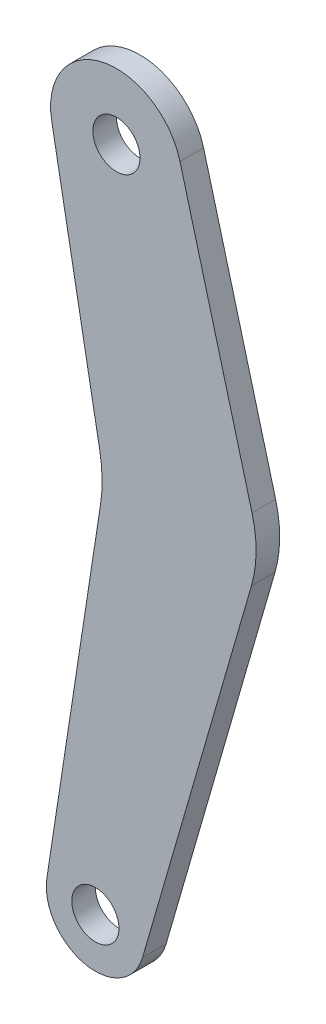
ISO-10303-21;
HEADER;
FILE_DESCRIPTION(('STEP AP214'),'2;1');
FILE_NAME('part.step','',(''),(''),'','','');
FILE_SCHEMA(('AUTOMOTIVE_DESIGN { 1 0 10303 214 1 1 1 1 }'));
ENDSEC;
DATA;
#1=APPLICATION_CONTEXT('core data for automotive mechanical design processes');
#2=APPLICATION_PROTOCOL_DEFINITION('international standard','automotive_design',2000,#1);
#3=PRODUCT_CONTEXT('',#1,'mechanical');
#4=PRODUCT('Part','Part','',(#3));
#5=PRODUCT_RELATED_PRODUCT_CATEGORY('part','',(#4));
#6=PRODUCT_DEFINITION_FORMATION('','',#4);
#7=PRODUCT_DEFINITION_CONTEXT('part definition',#1,'design');
#8=PRODUCT_DEFINITION('design','',#6,#7);
#9=PRODUCT_DEFINITION_SHAPE('','',#8);
#10=(LENGTH_UNIT() NAMED_UNIT(*) SI_UNIT(.MILLI.,.METRE.));
#11=(NAMED_UNIT(*) PLANE_ANGLE_UNIT() SI_UNIT($,.RADIAN.));
#12=(NAMED_UNIT(*) SI_UNIT($,.STERADIAN.) SOLID_ANGLE_UNIT());
#13=UNCERTAINTY_MEASURE_WITH_UNIT(LENGTH_MEASURE(1.E-05),#10,'distance_accuracy_value','');
#14=(GEOMETRIC_REPRESENTATION_CONTEXT(3) GLOBAL_UNCERTAINTY_ASSIGNED_CONTEXT((#13)) GLOBAL_UNIT_ASSIGNED_CONTEXT((#10,
#11,#12)) REPRESENTATION_CONTEXT('',''));
#15=CARTESIAN_POINT('',(0.,0.,0.));
#16=DIRECTION('',(0.,0.,1.));
#17=DIRECTION('',(1.,0.,0.));
#18=AXIS2_PLACEMENT_3D('',#15,#16,#17);
#19=CARTESIAN_POINT('',(-38.3285591147178,327.00705744007,0.));
#20=DIRECTION('',(0.,0.,1.));
#21=DIRECTION('',(1.,0.,0.));
#22=AXIS2_PLACEMENT_3D('',#19,#20,#21);
#23=PLANE('',#22);
#24=CARTESIAN_POINT('',(-38.3285591147178,327.00705744007,0.));
#25=DIRECTION('',(0.,0.,-1.));
#26=DIRECTION('',(-1.,0.,0.));
#27=AXIS2_PLACEMENT_3D('',#24,#25,#26);
#28=CIRCLE('',#27,0.999998000006309);
#29=CARTESIAN_POINT('',(-39.3285571147241,327.00705744007,0.));
#30=VERTEX_POINT('',#29);
#31=EDGE_CURVE('E109',#30,#30,#28,.F.);
#32=ORIENTED_EDGE('',*,*,#31,.T.);
#33=EDGE_LOOP('',(#32));
#34=FACE_BOUND('',#33,.T.);
#35=DIRECTION('',(0.151433090633254,0.988467510372122,0.));
#36=VECTOR('',#35,1.);
#37=CARTESIAN_POINT('',(-38.1119178424366,342.156577861668,0.));
#38=LINE('',#37,#36);
#39=CARTESIAN_POINT('',(-40.3845674242654,327.322037638626,0.));
#40=VERTEX_POINT('',#39);
#41=CARTESIAN_POINT('',(-38.1119178424365,342.156577861668,0.));
#42=VERTEX_POINT('',#41);
#43=EDGE_CURVE('E107',#40,#42,#38,.T.);
#44=ORIENTED_EDGE('',*,*,#43,.T.);
#45=CARTESIAN_POINT('',(-44.0427110430554,343.065174588271,0.));
#46=DIRECTION('',(0.,0.,-1.));
#47=DIRECTION('',(-1.,0.,0.));
#48=AXIS2_PLACEMENT_3D('',#45,#46,#47);
#49=CIRCLE('',#48,5.99998799999629);
#50=CARTESIAN_POINT('',(-38.1418631818201,344.151383830845,0.));
#51=VERTEX_POINT('',#50);
#52=EDGE_CURVE('E136',#42,#51,#49,.F.);
#53=ORIENTED_EDGE('',*,*,#52,.T.);
#54=DIRECTION('',(-0.181035235833503,0.983476610492953,0.));
#55=VECTOR('',#54,1.);
#56=CARTESIAN_POINT('',(-40.1796908064502,355.221912702271,0.));
#57=LINE('',#56,#55);
#58=CARTESIAN_POINT('',(-40.1796908064501,355.22191270227,0.));
#59=VERTEX_POINT('',#58);
#60=EDGE_CURVE('E110',#51,#59,#57,.T.);
#61=ORIENTED_EDGE('',*,*,#60,.T.);
#62=CARTESIAN_POINT('',(-37.4357965509737,355.727000000069,0.));
#63=DIRECTION('',(0.,0.,-1.));
#64=DIRECTION('',(-1.,0.,0.));
#65=AXIS2_PLACEMENT_3D('',#62,#63,#64);
#66=CIRCLE('',#65,2.78999442000039);
#67=CARTESIAN_POINT('',(-34.7412481703734,356.450517718053,0.));
#68=VERTEX_POINT('',#67);
#69=EDGE_CURVE('E139',#68,#59,#66,.F.);
#70=ORIENTED_EDGE('',*,*,#69,.F.);
#71=DIRECTION('',(0.259325865599312,-0.965789881615648,0.));
#72=VECTOR('',#71,1.);
#73=CARTESIAN_POINT('',(-31.6863937766294,345.073528938053,0.));
#74=LINE('',#73,#72);
#75=CARTESIAN_POINT('',(-31.6863937766299,345.073528938055,0.));
#76=VERTEX_POINT('',#75);
#77=EDGE_CURVE('E115',#68,#76,#74,.T.);
#78=ORIENTED_EDGE('',*,*,#77,.T.);
#79=CARTESIAN_POINT('',(-36.5153335268104,343.776902203319,0.));
#80=DIRECTION('',(0.,0.,-1.));
#81=DIRECTION('',(-1.,0.,0.));
#82=AXIS2_PLACEMENT_3D('',#79,#80,#81);
#83=CIRCLE('',#82,4.99999000000056);
#84=CARTESIAN_POINT('',(-31.7124149624369,342.386983765388,0.));
#85=VERTEX_POINT('',#84);
#86=EDGE_CURVE('E95',#85,#76,#83,.F.);
#87=ORIENTED_EDGE('',*,*,#86,.F.);
#88=DIRECTION('',(-0.277984243554049,-0.960585634046066,0.));
#89=VECTOR('',#88,1.);
#90=CARTESIAN_POINT('',(-36.3305449919396,326.428851369893,0.));
#91=LINE('',#90,#89);
#92=CARTESIAN_POINT('',(-36.3305449919397,326.428851369893,0.));
#93=VERTEX_POINT('',#92);
#94=EDGE_CURVE('E92',#85,#93,#91,.T.);
#95=ORIENTED_EDGE('',*,*,#94,.T.);
#96=CARTESIAN_POINT('',(-38.3285591147178,327.00705744007,0.));
#97=DIRECTION('',(0.,0.,-1.));
#98=DIRECTION('',(-1.,0.,0.));
#99=AXIS2_PLACEMENT_3D('',#96,#97,#98);
#100=CIRCLE('',#99,2.07999583999845);
#101=EDGE_CURVE('E80',#40,#93,#100,.F.);
#102=ORIENTED_EDGE('',*,*,#101,.F.);
#103=EDGE_LOOP('',(#44,#53,#61,#70,#78,#87,#95,#102));
#104=FACE_BOUND('',#103,.T.);
#105=CARTESIAN_POINT('',(-37.4357965509737,355.727000000069,0.));
#106=DIRECTION('',(0.,0.,-1.));
#107=DIRECTION('',(-1.,0.,0.));
#108=AXIS2_PLACEMENT_3D('',#105,#106,#107);
#109=CIRCLE('',#108,0.999998000004054);
#110=CARTESIAN_POINT('',(-38.4357945509778,355.727000000069,0.));
#111=VERTEX_POINT('',#110);
#112=EDGE_CURVE('E20',#111,#111,#109,.F.);
#113=ORIENTED_EDGE('',*,*,#112,.T.);
#114=EDGE_LOOP('',(#113));
#115=FACE_BOUND('',#114,.T.);
#116=ADVANCED_FACE('F17',(#34,#104,#115),#23,.F.);
#117=CARTESIAN_POINT('',(-37.4357965509737,355.727000000069,1.));
#118=DIRECTION('',(0.,0.,-1.));
#119=DIRECTION('',(-1.,0.,0.));
#120=AXIS2_PLACEMENT_3D('',#117,#118,#119);
#121=CYLINDRICAL_SURFACE('',#120,0.999998000004054);
#122=CARTESIAN_POINT('',(-37.4357965509737,355.727000000069,1.));
#123=DIRECTION('',(0.,0.,-1.));
#124=DIRECTION('',(-1.,0.,0.));
#125=AXIS2_PLACEMENT_3D('',#122,#123,#124);
#126=CIRCLE('',#125,0.999998000004054);
#127=CARTESIAN_POINT('',(-38.4357945509778,355.727000000069,1.));
#128=VERTEX_POINT('',#127);
#129=EDGE_CURVE('E131',#128,#128,#126,.T.);
#130=ORIENTED_EDGE('',*,*,#129,.F.);
#131=EDGE_LOOP('',(#130));
#132=FACE_BOUND('',#131,.T.);
#133=ORIENTED_EDGE('',*,*,#112,.F.);
#134=EDGE_LOOP('',(#133));
#135=FACE_BOUND('',#134,.T.);
#136=ADVANCED_FACE('F265',(#132,#135),#121,.F.);
#137=CARTESIAN_POINT('',(-38.3285591147178,327.00705744007,1.));
#138=DIRECTION('',(0.,0.,-1.));
#139=DIRECTION('',(-1.,0.,0.));
#140=AXIS2_PLACEMENT_3D('',#137,#138,#139);
#141=CYLINDRICAL_SURFACE('',#140,2.07999583999845);
#142=ORIENTED_EDGE('',*,*,#101,.T.);
#143=DIRECTION('',(0.,0.,1.));
#144=VECTOR('',#143,1.);
#145=CARTESIAN_POINT('',(-36.3305449919396,326.428851369893,1.));
#146=LINE('',#145,#144);
#147=CARTESIAN_POINT('',(-36.3305449919397,326.428851369893,1.));
#148=VERTEX_POINT('',#147);
#149=EDGE_CURVE('E84',#93,#148,#146,.T.);
#150=ORIENTED_EDGE('',*,*,#149,.T.);
#151=CARTESIAN_POINT('',(-38.3285591147178,327.00705744007,1.));
#152=DIRECTION('',(0.,0.,-1.));
#153=DIRECTION('',(-1.,0.,0.));
#154=AXIS2_PLACEMENT_3D('',#151,#152,#153);
#155=CIRCLE('',#154,2.07999583999845);
#156=CARTESIAN_POINT('',(-40.3845674242654,327.322037638626,1.));
#157=VERTEX_POINT('',#156);
#158=EDGE_CURVE('E129',#157,#148,#155,.F.);
#159=ORIENTED_EDGE('',*,*,#158,.F.);
#160=DIRECTION('',(0.,0.,1.));
#161=VECTOR('',#160,1.);
#162=CARTESIAN_POINT('',(-40.3845674242653,327.322037638626,1.));
#163=LINE('',#162,#161);
#164=EDGE_CURVE('E87',#157,#40,#163,.F.);
#165=ORIENTED_EDGE('',*,*,#164,.T.);
#166=EDGE_LOOP('',(#142,#150,#159,#165));
#167=FACE_BOUND('',#166,.T.);
#168=ADVANCED_FACE('F82',(#167),#141,.T.);
#169=CARTESIAN_POINT('',(-36.3305449919396,326.428851369893,1.));
#170=DIRECTION('',(-0.960585634046066,0.277984243554049,0.));
#171=DIRECTION('',(-0.277984243554049,-0.960585634046066,0.));
#172=AXIS2_PLACEMENT_3D('',#169,#170,#171);
#173=PLANE('',#172);
#174=DIRECTION('',(0.,0.,-1.));
#175=VECTOR('',#174,1.);
#176=CARTESIAN_POINT('',(-31.7124149624379,342.386983765384,1.));
#177=LINE('',#176,#175);
#178=CARTESIAN_POINT('',(-31.7124149624369,342.386983765388,1.));
#179=VERTEX_POINT('',#178);
#180=EDGE_CURVE('E105',#179,#85,#177,.T.);
#181=ORIENTED_EDGE('',*,*,#180,.F.);
#182=DIRECTION('',(0.277984243554049,0.960585634046066,0.));
#183=VECTOR('',#182,1.);
#184=CARTESIAN_POINT('',(-36.3305449919396,326.428851369893,1.));
#185=LINE('',#184,#183);
#186=EDGE_CURVE('E101',#148,#179,#185,.T.);
#187=ORIENTED_EDGE('',*,*,#186,.F.);
#188=ORIENTED_EDGE('',*,*,#149,.F.);
#189=ORIENTED_EDGE('',*,*,#94,.F.);
#190=EDGE_LOOP('',(#181,#187,#188,#189));
#191=FACE_BOUND('',#190,.T.);
#192=ADVANCED_FACE('F99',(#191),#173,.F.);
#193=CARTESIAN_POINT('',(-36.5153335268104,343.776902203319,1.));
#194=DIRECTION('',(0.,0.,-1.));
#195=DIRECTION('',(-1.,0.,0.));
#196=AXIS2_PLACEMENT_3D('',#193,#194,#195);
#197=CYLINDRICAL_SURFACE('',#196,4.99999000000056);
#198=CARTESIAN_POINT('',(-36.5153335268104,343.776902203319,1.));
#199=DIRECTION('',(0.,0.,-1.));
#200=DIRECTION('',(-1.,0.,0.));
#201=AXIS2_PLACEMENT_3D('',#198,#199,#200);
#202=CIRCLE('',#201,4.99999000000056);
#203=CARTESIAN_POINT('',(-31.6863937766299,345.073528938055,1.));
#204=VERTEX_POINT('',#203);
#205=EDGE_CURVE('E126',#179,#204,#202,.F.);
#206=ORIENTED_EDGE('',*,*,#205,.F.);
#207=ORIENTED_EDGE('',*,*,#180,.T.);
#208=ORIENTED_EDGE('',*,*,#86,.T.);
#209=DIRECTION('',(0.,0.,1.));
#210=VECTOR('',#209,1.);
#211=CARTESIAN_POINT('',(-31.6863937766294,345.073528938053,1.));
#212=LINE('',#211,#210);
#213=EDGE_CURVE('E117',#76,#204,#212,.T.);
#214=ORIENTED_EDGE('',*,*,#213,.T.);
#215=EDGE_LOOP('',(#206,#207,#208,#214));
#216=FACE_BOUND('',#215,.T.);
#217=ADVANCED_FACE('F176',(#216),#197,.T.);
#218=CARTESIAN_POINT('',(-31.6863937766294,345.073528938053,1.));
#219=DIRECTION('',(-0.965789881615648,-0.259325865599312,0.));
#220=DIRECTION('',(0.259325865599312,-0.965789881615648,0.));
#221=AXIS2_PLACEMENT_3D('',#218,#219,#220);
#222=PLANE('',#221);
#223=DIRECTION('',(0.,0.,-1.));
#224=VECTOR('',#223,1.);
#225=CARTESIAN_POINT('',(-34.7412481703736,356.450517718054,1.));
#226=LINE('',#225,#224);
#227=CARTESIAN_POINT('',(-34.7412481703734,356.450517718053,1.));
#228=VERTEX_POINT('',#227);
#229=EDGE_CURVE('E116',#228,#68,#226,.T.);
#230=ORIENTED_EDGE('',*,*,#229,.F.);
#231=DIRECTION('',(-0.259325865599313,0.965789881615648,0.));
#232=VECTOR('',#231,1.);
#233=CARTESIAN_POINT('',(-31.6863937766294,345.073528938053,1.));
#234=LINE('',#233,#232);
#235=EDGE_CURVE('E125',#204,#228,#234,.T.);
#236=ORIENTED_EDGE('',*,*,#235,.F.);
#237=ORIENTED_EDGE('',*,*,#213,.F.);
#238=ORIENTED_EDGE('',*,*,#77,.F.);
#239=EDGE_LOOP('',(#230,#236,#237,#238));
#240=FACE_BOUND('',#239,.T.);
#241=ADVANCED_FACE('F175',(#240),#222,.F.);
#242=CARTESIAN_POINT('',(-37.4357965509737,355.727000000069,1.));
#243=DIRECTION('',(0.,0.,-1.));
#244=DIRECTION('',(-1.,0.,0.));
#245=AXIS2_PLACEMENT_3D('',#242,#243,#244);
#246=CYLINDRICAL_SURFACE('',#245,2.78999442000039);
#247=ORIENTED_EDGE('',*,*,#69,.T.);
#248=DIRECTION('',(0.,0.,1.));
#249=VECTOR('',#248,1.);
#250=CARTESIAN_POINT('',(-40.1796908064502,355.221912702271,1.));
#251=LINE('',#250,#249);
#252=CARTESIAN_POINT('',(-40.1796908064501,355.22191270227,1.));
#253=VERTEX_POINT('',#252);
#254=EDGE_CURVE('E114',#59,#253,#251,.T.);
#255=ORIENTED_EDGE('',*,*,#254,.T.);
#256=CARTESIAN_POINT('',(-37.4357965509737,355.727000000069,1.));
#257=DIRECTION('',(0.,0.,-1.));
#258=DIRECTION('',(-1.,0.,0.));
#259=AXIS2_PLACEMENT_3D('',#256,#257,#258);
#260=CIRCLE('',#259,2.78999442000039);
#261=EDGE_CURVE('E123',#228,#253,#260,.F.);
#262=ORIENTED_EDGE('',*,*,#261,.F.);
#263=ORIENTED_EDGE('',*,*,#229,.T.);
#264=EDGE_LOOP('',(#247,#255,#262,#263));
#265=FACE_BOUND('',#264,.T.);
#266=ADVANCED_FACE('F172',(#265),#246,.T.);
#267=CARTESIAN_POINT('',(-40.1796908064502,355.221912702271,1.));
#268=DIRECTION('',(0.983476610492953,0.181035235833503,0.));
#269=DIRECTION('',(-0.181035235833503,0.983476610492953,0.));
#270=AXIS2_PLACEMENT_3D('',#267,#268,#269);
#271=PLANE('',#270);
#272=DIRECTION('',(0.,0.,-1.));
#273=VECTOR('',#272,1.);
#274=CARTESIAN_POINT('',(-38.1418631818195,344.151383830842,1.));
#275=LINE('',#274,#273);
#276=CARTESIAN_POINT('',(-38.1418631818201,344.151383830845,1.));
#277=VERTEX_POINT('',#276);
#278=EDGE_CURVE('E113',#51,#277,#275,.F.);
#279=ORIENTED_EDGE('',*,*,#278,.T.);
#280=DIRECTION('',(0.181035235833502,-0.983476610492953,0.));
#281=VECTOR('',#280,1.);
#282=CARTESIAN_POINT('',(-40.1796908064502,355.221912702271,1.));
#283=LINE('',#282,#281);
#284=EDGE_CURVE('E122',#253,#277,#283,.T.);
#285=ORIENTED_EDGE('',*,*,#284,.F.);
#286=ORIENTED_EDGE('',*,*,#254,.F.);
#287=ORIENTED_EDGE('',*,*,#60,.F.);
#288=EDGE_LOOP('',(#279,#285,#286,#287));
#289=FACE_BOUND('',#288,.T.);
#290=ADVANCED_FACE('F169',(#289),#271,.F.);
#291=CARTESIAN_POINT('',(-44.0427110430554,343.065174588271,1.));
#292=DIRECTION('',(0.,0.,-1.));
#293=DIRECTION('',(-1.,0.,0.));
#294=AXIS2_PLACEMENT_3D('',#291,#292,#293);
#295=CYLINDRICAL_SURFACE('',#294,5.99998799999629);
#296=DIRECTION('',(0.,0.,1.));
#297=VECTOR('',#296,1.);
#298=CARTESIAN_POINT('',(-38.1119178424366,342.156577861668,1.));
#299=LINE('',#298,#297);
#300=CARTESIAN_POINT('',(-38.1119178424365,342.156577861668,1.));
#301=VERTEX_POINT('',#300);
#302=EDGE_CURVE('E35',#42,#301,#299,.T.);
#303=ORIENTED_EDGE('',*,*,#302,.T.);
#304=CARTESIAN_POINT('',(-44.0427110430554,343.065174588271,1.));
#305=DIRECTION('',(0.,0.,-1.));
#306=DIRECTION('',(-1.,0.,0.));
#307=AXIS2_PLACEMENT_3D('',#304,#305,#306);
#308=CIRCLE('',#307,5.99998799999629);
#309=EDGE_CURVE('E119',#277,#301,#308,.T.);
#310=ORIENTED_EDGE('',*,*,#309,.F.);
#311=ORIENTED_EDGE('',*,*,#278,.F.);
#312=ORIENTED_EDGE('',*,*,#52,.F.);
#313=EDGE_LOOP('',(#303,#310,#311,#312));
#314=FACE_BOUND('',#313,.T.);
#315=ADVANCED_FACE('F166',(#314),#295,.F.);
#316=CARTESIAN_POINT('',(-38.1119178424366,342.156577861668,1.));
#317=DIRECTION('',(0.988467510372122,-0.151433090633254,0.));
#318=DIRECTION('',(0.151433090633254,0.988467510372122,0.));
#319=AXIS2_PLACEMENT_3D('',#316,#317,#318);
#320=PLANE('',#319);
#321=ORIENTED_EDGE('',*,*,#164,.F.);
#322=DIRECTION('',(-0.151433090633254,-0.988467510372122,0.));
#323=VECTOR('',#322,1.);
#324=CARTESIAN_POINT('',(-38.1119178424366,342.156577861668,1.));
#325=LINE('',#324,#323);
#326=EDGE_CURVE('E26',#301,#157,#325,.T.);
#327=ORIENTED_EDGE('',*,*,#326,.F.);
#328=ORIENTED_EDGE('',*,*,#302,.F.);
#329=ORIENTED_EDGE('',*,*,#43,.F.);
#330=EDGE_LOOP('',(#321,#327,#328,#329));
#331=FACE_BOUND('',#330,.T.);
#332=ADVANCED_FACE('F163',(#331),#320,.F.);
#333=CARTESIAN_POINT('',(-38.3285591147178,327.00705744007,1.));
#334=DIRECTION('',(0.,0.,-1.));
#335=DIRECTION('',(-1.,0.,0.));
#336=AXIS2_PLACEMENT_3D('',#333,#334,#335);
#337=CYLINDRICAL_SURFACE('',#336,0.999998000006309);
#338=CARTESIAN_POINT('',(-38.3285591147178,327.00705744007,1.));
#339=DIRECTION('',(0.,0.,-1.));
#340=DIRECTION('',(-1.,0.,0.));
#341=AXIS2_PLACEMENT_3D('',#338,#339,#340);
#342=CIRCLE('',#341,0.999998000006309);
#343=CARTESIAN_POINT('',(-39.3285571147241,327.00705744007,1.));
#344=VERTEX_POINT('',#343);
#345=EDGE_CURVE('E11',#344,#344,#342,.T.);
#346=ORIENTED_EDGE('',*,*,#345,.F.);
#347=EDGE_LOOP('',(#346));
#348=FACE_BOUND('',#347,.T.);
#349=ORIENTED_EDGE('',*,*,#31,.F.);
#350=EDGE_LOOP('',(#349));
#351=FACE_BOUND('',#350,.T.);
#352=ADVANCED_FACE('F187',(#348,#351),#337,.F.);
#353=CARTESIAN_POINT('',(-38.3285591147178,327.00705744007,1.));
#354=DIRECTION('',(0.,0.,1.));
#355=DIRECTION('',(1.,0.,0.));
#356=AXIS2_PLACEMENT_3D('',#353,#354,#355);
#357=PLANE('',#356);
#358=ORIENTED_EDGE('',*,*,#345,.T.);
#359=EDGE_LOOP('',(#358));
#360=FACE_BOUND('',#359,.T.);
#361=ORIENTED_EDGE('',*,*,#309,.T.);
#362=ORIENTED_EDGE('',*,*,#326,.T.);
#363=ORIENTED_EDGE('',*,*,#158,.T.);
#364=ORIENTED_EDGE('',*,*,#186,.T.);
#365=ORIENTED_EDGE('',*,*,#205,.T.);
#366=ORIENTED_EDGE('',*,*,#235,.T.);
#367=ORIENTED_EDGE('',*,*,#261,.T.);
#368=ORIENTED_EDGE('',*,*,#284,.T.);
#369=EDGE_LOOP('',(#361,#362,#363,#364,#365,#366,#367,#368));
#370=FACE_BOUND('',#369,.T.);
#371=ORIENTED_EDGE('',*,*,#129,.T.);
#372=EDGE_LOOP('',(#371));
#373=FACE_BOUND('',#372,.T.);
#374=ADVANCED_FACE('F160',(#360,#370,#373),#357,.T.);
#375=CLOSED_SHELL('',(#116,#136,#168,#192,#217,#241,#266,#290,#315,#332,#352,#374));
#376=MANIFOLD_SOLID_BREP('B1',#375);
#377=ADVANCED_BREP_SHAPE_REPRESENTATION('',(#18,#376),#14);
#378=SHAPE_DEFINITION_REPRESENTATION(#9,#377);
ENDSEC;
END-ISO-10303-21;
